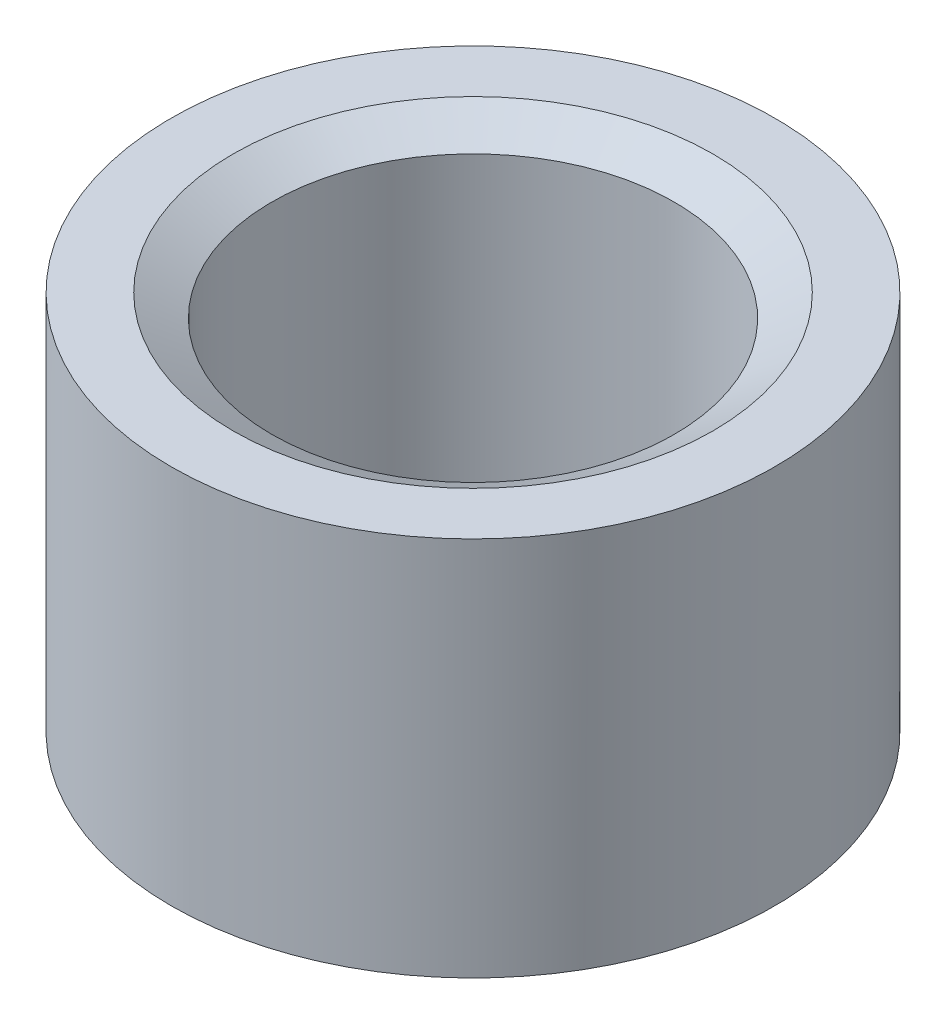
ISO-10303-21;
HEADER;
FILE_DESCRIPTION(('STEP AP214'),'2;1');
FILE_NAME('part.step','',(''),(''),'','','');
FILE_SCHEMA(('AUTOMOTIVE_DESIGN { 1 0 10303 214 1 1 1 1 }'));
ENDSEC;
DATA;
#1=APPLICATION_CONTEXT('core data for automotive mechanical design processes');
#2=APPLICATION_PROTOCOL_DEFINITION('international standard','automotive_design',2000,#1);
#3=PRODUCT_CONTEXT('',#1,'mechanical');
#4=PRODUCT('Part','Part','',(#3));
#5=PRODUCT_RELATED_PRODUCT_CATEGORY('part','',(#4));
#6=PRODUCT_DEFINITION_FORMATION('','',#4);
#7=PRODUCT_DEFINITION_CONTEXT('part definition',#1,'design');
#8=PRODUCT_DEFINITION('design','',#6,#7);
#9=PRODUCT_DEFINITION_SHAPE('','',#8);
#10=(LENGTH_UNIT() NAMED_UNIT(*) SI_UNIT(.MILLI.,.METRE.));
#11=(NAMED_UNIT(*) PLANE_ANGLE_UNIT() SI_UNIT($,.RADIAN.));
#12=(NAMED_UNIT(*) SI_UNIT($,.STERADIAN.) SOLID_ANGLE_UNIT());
#13=UNCERTAINTY_MEASURE_WITH_UNIT(LENGTH_MEASURE(1.E-05),#10,'distance_accuracy_value','');
#14=(GEOMETRIC_REPRESENTATION_CONTEXT(3) GLOBAL_UNCERTAINTY_ASSIGNED_CONTEXT((#13)) GLOBAL_UNIT_ASSIGNED_CONTEXT((#10,
#11,#12)) REPRESENTATION_CONTEXT('',''));
#15=CARTESIAN_POINT('',(0.,0.,0.));
#16=DIRECTION('',(0.,0.,1.));
#17=DIRECTION('',(1.,0.,0.));
#18=AXIS2_PLACEMENT_3D('',#15,#16,#17);
#19=CARTESIAN_POINT('',(0.,0.,0.));
#20=DIRECTION('',(0.,1.,0.));
#21=DIRECTION('',(0.,0.,1.));
#22=AXIS2_PLACEMENT_3D('',#19,#20,#21);
#23=CYLINDRICAL_SURFACE('',#22,2.38125);
#24=CARTESIAN_POINT('',(0.,-2.999023637951,0.));
#25=DIRECTION('',(0.,-1.,0.));
#26=DIRECTION('',(0.,0.,-1.));
#27=AXIS2_PLACEMENT_3D('',#24,#25,#26);
#28=CIRCLE('',#27,2.38125);
#29=CARTESIAN_POINT('',(0.,-2.999023637951,-2.38125));
#30=VERTEX_POINT('',#29);
#31=EDGE_CURVE('E37',#30,#30,#28,.F.);
#32=ORIENTED_EDGE('',*,*,#31,.T.);
#33=EDGE_LOOP('',(#32));
#34=FACE_BOUND('',#33,.T.);
#35=CARTESIAN_POINT('',(0.,0.,0.));
#36=DIRECTION('',(0.,1.,0.));
#37=DIRECTION('',(0.,0.,1.));
#38=AXIS2_PLACEMENT_3D('',#35,#36,#37);
#39=CIRCLE('',#38,2.38125);
#40=CARTESIAN_POINT('',(0.,0.,2.38125));
#41=VERTEX_POINT('',#40);
#42=EDGE_CURVE('E53',#41,#41,#39,.T.);
#43=ORIENTED_EDGE('',*,*,#42,.F.);
#44=EDGE_LOOP('',(#43));
#45=FACE_BOUND('',#44,.T.);
#46=ADVANCED_FACE('F30',(#34,#45),#23,.T.);
#47=CARTESIAN_POINT('',(2.38125,-3.175,0.));
#48=DIRECTION('',(0.,-1.,0.));
#49=DIRECTION('',(0.,0.,-1.));
#50=AXIS2_PLACEMENT_3D('',#47,#48,#49);
#51=PLANE('',#50);
#52=CARTESIAN_POINT('',(0.,-3.175,0.));
#53=DIRECTION('',(0.,-1.,0.));
#54=DIRECTION('',(0.,0.,-1.));
#55=AXIS2_PLACEMENT_3D('',#52,#53,#54);
#56=CIRCLE('',#55,2.07645);
#57=CARTESIAN_POINT('',(0.,-3.175,-2.07645));
#58=VERTEX_POINT('',#57);
#59=EDGE_CURVE('E10',#58,#58,#56,.T.);
#60=ORIENTED_EDGE('',*,*,#59,.T.);
#61=EDGE_LOOP('',(#60));
#62=FACE_BOUND('',#61,.T.);
#63=CARTESIAN_POINT('',(0.,-3.175,0.));
#64=DIRECTION('',(0.,1.,0.));
#65=DIRECTION('',(0.,0.,1.));
#66=AXIS2_PLACEMENT_3D('',#63,#64,#65);
#67=CIRCLE('',#66,1.5875);
#68=CARTESIAN_POINT('',(0.,-3.175,1.5875));
#69=VERTEX_POINT('',#68);
#70=EDGE_CURVE('E50',#69,#69,#67,.T.);
#71=ORIENTED_EDGE('',*,*,#70,.T.);
#72=EDGE_LOOP('',(#71));
#73=FACE_BOUND('',#72,.T.);
#74=ADVANCED_FACE('F60',(#62,#73),#51,.T.);
#75=CARTESIAN_POINT('',(0.,0.,0.));
#76=DIRECTION('',(0.,1.,0.));
#77=DIRECTION('',(0.,0.,1.));
#78=AXIS2_PLACEMENT_3D('',#75,#76,#77);
#79=CYLINDRICAL_SURFACE('',#78,1.5875);
#80=CARTESIAN_POINT('',(0.,-0.175976362048998,0.));
#81=DIRECTION('',(0.,1.,0.));
#82=DIRECTION('',(0.,0.,1.));
#83=AXIS2_PLACEMENT_3D('',#80,#81,#82);
#84=CIRCLE('',#83,1.5875);
#85=CARTESIAN_POINT('',(0.,-0.175976362048998,1.5875));
#86=VERTEX_POINT('',#85);
#87=EDGE_CURVE('E45',#86,#86,#84,.T.);
#88=ORIENTED_EDGE('',*,*,#87,.T.);
#89=EDGE_LOOP('',(#88));
#90=FACE_BOUND('',#89,.T.);
#91=ORIENTED_EDGE('',*,*,#70,.F.);
#92=EDGE_LOOP('',(#91));
#93=FACE_BOUND('',#92,.T.);
#94=ADVANCED_FACE('F65',(#90,#93),#79,.F.);
#95=CARTESIAN_POINT('',(2.38125,0.,0.));
#96=DIRECTION('',(0.,1.,0.));
#97=DIRECTION('',(0.,0.,1.));
#98=AXIS2_PLACEMENT_3D('',#95,#96,#97);
#99=PLANE('',#98);
#100=CARTESIAN_POINT('',(0.,0.,0.));
#101=DIRECTION('',(0.,1.,0.));
#102=DIRECTION('',(0.,0.,1.));
#103=AXIS2_PLACEMENT_3D('',#100,#101,#102);
#104=CIRCLE('',#103,1.8923);
#105=CARTESIAN_POINT('',(0.,0.,1.8923));
#106=VERTEX_POINT('',#105);
#107=EDGE_CURVE('E41',#106,#106,#104,.F.);
#108=ORIENTED_EDGE('',*,*,#107,.T.);
#109=EDGE_LOOP('',(#108));
#110=FACE_BOUND('',#109,.T.);
#111=ORIENTED_EDGE('',*,*,#42,.T.);
#112=EDGE_LOOP('',(#111));
#113=FACE_BOUND('',#112,.T.);
#114=ADVANCED_FACE('F57',(#110,#113),#99,.T.);
#115=CARTESIAN_POINT('',(0.,-0.175976362048998,0.));
#116=DIRECTION('',(0.,1.,0.));
#117=DIRECTION('',(0.,0.,1.));
#118=AXIS2_PLACEMENT_3D('',#115,#116,#117);
#119=CONICAL_SURFACE('',#118,1.5875,1.0471975511966);
#120=ORIENTED_EDGE('',*,*,#107,.F.);
#121=EDGE_LOOP('',(#120));
#122=FACE_BOUND('',#121,.T.);
#123=ORIENTED_EDGE('',*,*,#87,.F.);
#124=EDGE_LOOP('',(#123));
#125=FACE_BOUND('',#124,.T.);
#126=ADVANCED_FACE('F68',(#122,#125),#119,.F.);
#127=CARTESIAN_POINT('',(0.,-2.999023637951,0.));
#128=DIRECTION('',(0.,1.,0.));
#129=DIRECTION('',(0.,0.,1.));
#130=AXIS2_PLACEMENT_3D('',#127,#128,#129);
#131=CONICAL_SURFACE('',#130,2.38125,1.0471975511966);
#132=ORIENTED_EDGE('',*,*,#59,.F.);
#133=EDGE_LOOP('',(#132));
#134=FACE_BOUND('',#133,.T.);
#135=ORIENTED_EDGE('',*,*,#31,.F.);
#136=EDGE_LOOP('',(#135));
#137=FACE_BOUND('',#136,.T.);
#138=ADVANCED_FACE('F32',(#134,#137),#131,.T.);
#139=CLOSED_SHELL('',(#46,#74,#94,#114,#126,#138));
#140=MANIFOLD_SOLID_BREP('B2',#139);
#141=ADVANCED_BREP_SHAPE_REPRESENTATION('',(#18,#140),#14);
#142=SHAPE_DEFINITION_REPRESENTATION(#9,#141);
ENDSEC;
END-ISO-10303-21;
